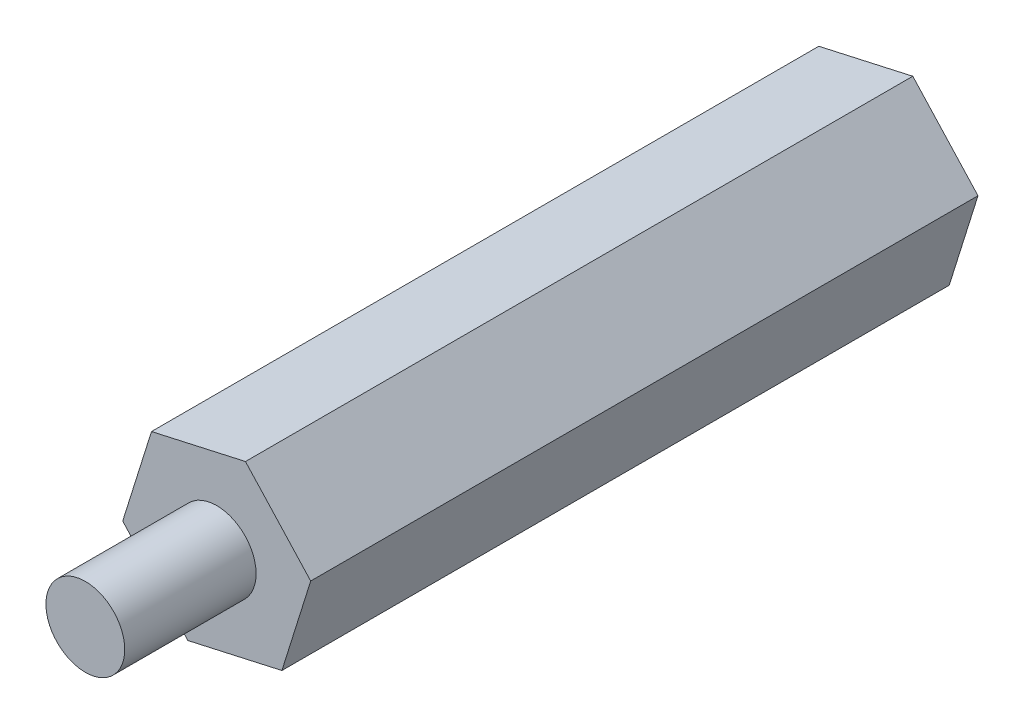
ISO-10303-21;
HEADER;
FILE_DESCRIPTION(('STEP AP214'),'2;1');
FILE_NAME('part.step','',(''),(''),'','','');
FILE_SCHEMA(('AUTOMOTIVE_DESIGN { 1 0 10303 214 1 1 1 1 }'));
ENDSEC;
DATA;
#1=APPLICATION_CONTEXT('core data for automotive mechanical design processes');
#2=APPLICATION_PROTOCOL_DEFINITION('international standard','automotive_design',2000,#1);
#3=PRODUCT_CONTEXT('',#1,'mechanical');
#4=PRODUCT('Part','Part','',(#3));
#5=PRODUCT_RELATED_PRODUCT_CATEGORY('part','',(#4));
#6=PRODUCT_DEFINITION_FORMATION('','',#4);
#7=PRODUCT_DEFINITION_CONTEXT('part definition',#1,'design');
#8=PRODUCT_DEFINITION('design','',#6,#7);
#9=PRODUCT_DEFINITION_SHAPE('','',#8);
#10=(LENGTH_UNIT() NAMED_UNIT(*) SI_UNIT(.MILLI.,.METRE.));
#11=(NAMED_UNIT(*) PLANE_ANGLE_UNIT() SI_UNIT($,.RADIAN.));
#12=(NAMED_UNIT(*) SI_UNIT($,.STERADIAN.) SOLID_ANGLE_UNIT());
#13=UNCERTAINTY_MEASURE_WITH_UNIT(LENGTH_MEASURE(1.E-05),#10,'distance_accuracy_value','');
#14=(GEOMETRIC_REPRESENTATION_CONTEXT(3) GLOBAL_UNCERTAINTY_ASSIGNED_CONTEXT((#13)) GLOBAL_UNIT_ASSIGNED_CONTEXT((#10,
#11,#12)) REPRESENTATION_CONTEXT('',''));
#15=CARTESIAN_POINT('',(0.,0.,0.));
#16=DIRECTION('',(0.,0.,1.));
#17=DIRECTION('',(1.,0.,0.));
#18=AXIS2_PLACEMENT_3D('',#15,#16,#17);
#19=CARTESIAN_POINT('',(0.,0.,30.4));
#20=DIRECTION('',(0.,0.,-1.));
#21=DIRECTION('',(-1.,0.,0.));
#22=AXIS2_PLACEMENT_3D('',#19,#20,#21);
#23=CYLINDRICAL_SURFACE('',#22,1.5);
#24=CARTESIAN_POINT('',(0.,0.,30.4));
#25=DIRECTION('',(0.,0.,1.));
#26=DIRECTION('',(1.,0.,0.));
#27=AXIS2_PLACEMENT_3D('',#24,#25,#26);
#28=CIRCLE('',#27,1.5);
#29=CARTESIAN_POINT('',(1.5,0.,30.4));
#30=VERTEX_POINT('',#29);
#31=EDGE_CURVE('E11',#30,#30,#28,.T.);
#32=ORIENTED_EDGE('',*,*,#31,.F.);
#33=EDGE_LOOP('',(#32));
#34=FACE_BOUND('',#33,.T.);
#35=CARTESIAN_POINT('',(0.,0.,25.4));
#36=DIRECTION('',(0.,0.,1.));
#37=DIRECTION('',(1.,0.,0.));
#38=AXIS2_PLACEMENT_3D('',#35,#36,#37);
#39=CIRCLE('',#38,1.5);
#40=CARTESIAN_POINT('',(1.5,0.,25.4));
#41=VERTEX_POINT('',#40);
#42=EDGE_CURVE('E44',#41,#41,#39,.T.);
#43=ORIENTED_EDGE('',*,*,#42,.T.);
#44=EDGE_LOOP('',(#43));
#45=FACE_BOUND('',#44,.T.);
#46=ADVANCED_FACE('F41',(#34,#45),#23,.T.);
#47=CARTESIAN_POINT('',(0.,0.,30.4));
#48=DIRECTION('',(0.,0.,1.));
#49=DIRECTION('',(1.,0.,0.));
#50=AXIS2_PLACEMENT_3D('',#47,#48,#49);
#51=PLANE('',#50);
#52=ORIENTED_EDGE('',*,*,#31,.T.);
#53=EDGE_LOOP('',(#52));
#54=FACE_BOUND('',#53,.T.);
#55=ADVANCED_FACE('F56',(#54),#51,.T.);
#56=CARTESIAN_POINT('',(0.,0.,25.4));
#57=DIRECTION('',(0.,0.,1.));
#58=DIRECTION('',(1.,0.,0.));
#59=AXIS2_PLACEMENT_3D('',#56,#57,#58);
#60=PLANE('',#59);
#61=ORIENTED_EDGE('',*,*,#42,.F.);
#62=EDGE_LOOP('',(#61));
#63=FACE_BOUND('',#62,.T.);
#64=ADVANCED_FACE('F54',(#63),#60,.F.);
#65=CLOSED_SHELL('',(#46,#55,#64));
#66=MANIFOLD_SOLID_BREP('B2',#65);
#67=CARTESIAN_POINT('',(0.,0.,25.4));
#68=DIRECTION('',(0.,0.,1.));
#69=DIRECTION('',(1.,0.,0.));
#70=AXIS2_PLACEMENT_3D('',#67,#68,#69);
#71=PLANE('',#70);
#72=DIRECTION('',(0.975877207402578,0.218320122920782,0.));
#73=VECTOR('',#72,1.);
#74=CARTESIAN_POINT('',(-1.09570153436444,-3.49860993552078,25.4));
#75=LINE('',#74,#73);
#76=CARTESIAN_POINT('',(-1.09570153436444,-3.49860993552078,25.4));
#77=VERTEX_POINT('',#76);
#78=CARTESIAN_POINT('',(2.48203431491141,-2.69821033148559,25.4));
#79=VERTEX_POINT('',#78);
#80=EDGE_CURVE('E178',#77,#79,#75,.T.);
#81=ORIENTED_EDGE('',*,*,#80,.T.);
#82=DIRECTION('',(0.298867831094551,0.954294514045239,0.));
#83=VECTOR('',#82,1.);
#84=CARTESIAN_POINT('',(2.48203431491141,-2.69821033148559,25.4));
#85=LINE('',#84,#83);
#86=CARTESIAN_POINT('',(3.57773584927586,0.800399604035192,25.4));
#87=VERTEX_POINT('',#86);
#88=EDGE_CURVE('E136',#79,#87,#85,.T.);
#89=ORIENTED_EDGE('',*,*,#88,.T.);
#90=DIRECTION('',(-0.677009376308027,0.735974391124457,0.));
#91=VECTOR('',#90,1.);
#92=CARTESIAN_POINT('',(3.57773584927586,0.800399604035192,25.4));
#93=LINE('',#92,#91);
#94=CARTESIAN_POINT('',(1.09570153436445,3.49860993552078,25.4));
#95=VERTEX_POINT('',#94);
#96=EDGE_CURVE('E149',#87,#95,#93,.T.);
#97=ORIENTED_EDGE('',*,*,#96,.T.);
#98=DIRECTION('',(-0.975877207402578,-0.218320122920782,0.));
#99=VECTOR('',#98,1.);
#100=CARTESIAN_POINT('',(1.09570153436445,3.49860993552078,25.4));
#101=LINE('',#100,#99);
#102=CARTESIAN_POINT('',(-2.48203431491141,2.69821033148559,25.4));
#103=VERTEX_POINT('',#102);
#104=EDGE_CURVE('E143',#95,#103,#101,.T.);
#105=ORIENTED_EDGE('',*,*,#104,.T.);
#106=DIRECTION('',(-0.298867831094551,-0.954294514045239,0.));
#107=VECTOR('',#106,1.);
#108=CARTESIAN_POINT('',(-2.48203431491141,2.69821033148559,25.4));
#109=LINE('',#108,#107);
#110=CARTESIAN_POINT('',(-3.57773584927586,-0.800399604035191,25.4));
#111=VERTEX_POINT('',#110);
#112=EDGE_CURVE('E147',#103,#111,#109,.T.);
#113=ORIENTED_EDGE('',*,*,#112,.T.);
#114=DIRECTION('',(0.677009376308027,-0.735974391124457,0.));
#115=VECTOR('',#114,1.);
#116=CARTESIAN_POINT('',(-3.57773584927586,-0.800399604035191,25.4));
#117=LINE('',#116,#115);
#118=EDGE_CURVE('E99',#111,#77,#117,.T.);
#119=ORIENTED_EDGE('',*,*,#118,.T.);
#120=EDGE_LOOP('',(#81,#89,#97,#105,#113,#119));
#121=FACE_BOUND('',#120,.T.);
#122=CARTESIAN_POINT('',(0.,0.,25.4));
#123=DIRECTION('',(0.,0.,1.));
#124=DIRECTION('',(1.,0.,0.));
#125=AXIS2_PLACEMENT_3D('',#122,#123,#124);
#126=CIRCLE('',#125,1.5);
#127=CARTESIAN_POINT('',(1.5,0.,25.4));
#128=VERTEX_POINT('',#127);
#129=EDGE_CURVE('E171',#128,#128,#126,.T.);
#130=ORIENTED_EDGE('',*,*,#129,.F.);
#131=EDGE_LOOP('',(#130));
#132=FACE_BOUND('',#131,.T.);
#133=ADVANCED_FACE('F82',(#121,#132),#71,.T.);
#134=CARTESIAN_POINT('',(0.,0.,0.));
#135=DIRECTION('',(0.,0.,1.));
#136=DIRECTION('',(1.,0.,0.));
#137=AXIS2_PLACEMENT_3D('',#134,#135,#136);
#138=PLANE('',#137);
#139=DIRECTION('',(0.975877207402578,0.218320122920782,0.));
#140=VECTOR('',#139,1.);
#141=CARTESIAN_POINT('',(-1.09570153436444,-3.49860993552078,0.));
#142=LINE('',#141,#140);
#143=CARTESIAN_POINT('',(-1.09570153436444,-3.49860993552078,0.));
#144=VERTEX_POINT('',#143);
#145=CARTESIAN_POINT('',(2.48203431491141,-2.69821033148559,0.));
#146=VERTEX_POINT('',#145);
#147=EDGE_CURVE('E167',#144,#146,#142,.T.);
#148=ORIENTED_EDGE('',*,*,#147,.F.);
#149=DIRECTION('',(0.677009376308027,-0.735974391124457,0.));
#150=VECTOR('',#149,1.);
#151=CARTESIAN_POINT('',(-3.57773584927586,-0.800399604035191,0.));
#152=LINE('',#151,#150);
#153=CARTESIAN_POINT('',(-3.57773584927586,-0.800399604035191,0.));
#154=VERTEX_POINT('',#153);
#155=EDGE_CURVE('E128',#154,#144,#152,.T.);
#156=ORIENTED_EDGE('',*,*,#155,.F.);
#157=DIRECTION('',(-0.298867831094551,-0.954294514045239,0.));
#158=VECTOR('',#157,1.);
#159=CARTESIAN_POINT('',(-2.48203431491141,2.69821033148559,0.));
#160=LINE('',#159,#158);
#161=CARTESIAN_POINT('',(-2.48203431491141,2.69821033148559,0.));
#162=VERTEX_POINT('',#161);
#163=EDGE_CURVE('E122',#162,#154,#160,.T.);
#164=ORIENTED_EDGE('',*,*,#163,.F.);
#165=DIRECTION('',(-0.975877207402578,-0.218320122920782,0.));
#166=VECTOR('',#165,1.);
#167=CARTESIAN_POINT('',(1.09570153436445,3.49860993552078,0.));
#168=LINE('',#167,#166);
#169=CARTESIAN_POINT('',(1.09570153436445,3.49860993552078,0.));
#170=VERTEX_POINT('',#169);
#171=EDGE_CURVE('E157',#170,#162,#168,.T.);
#172=ORIENTED_EDGE('',*,*,#171,.F.);
#173=DIRECTION('',(-0.677009376308027,0.735974391124457,0.));
#174=VECTOR('',#173,1.);
#175=CARTESIAN_POINT('',(3.57773584927586,0.800399604035192,0.));
#176=LINE('',#175,#174);
#177=CARTESIAN_POINT('',(3.57773584927586,0.800399604035192,0.));
#178=VERTEX_POINT('',#177);
#179=EDGE_CURVE('E173',#178,#170,#176,.T.);
#180=ORIENTED_EDGE('',*,*,#179,.F.);
#181=DIRECTION('',(0.298867831094551,0.954294514045239,0.));
#182=VECTOR('',#181,1.);
#183=CARTESIAN_POINT('',(2.48203431491141,-2.69821033148559,0.));
#184=LINE('',#183,#182);
#185=EDGE_CURVE('E170',#146,#178,#184,.T.);
#186=ORIENTED_EDGE('',*,*,#185,.F.);
#187=EDGE_LOOP('',(#148,#156,#164,#172,#180,#186));
#188=FACE_BOUND('',#187,.T.);
#189=CARTESIAN_POINT('',(0.,0.,0.));
#190=DIRECTION('',(0.,0.,1.));
#191=DIRECTION('',(1.,0.,0.));
#192=AXIS2_PLACEMENT_3D('',#189,#190,#191);
#193=CIRCLE('',#192,1.5);
#194=CARTESIAN_POINT('',(1.5,0.,0.));
#195=VERTEX_POINT('',#194);
#196=EDGE_CURVE('E271',#195,#195,#193,.T.);
#197=ORIENTED_EDGE('',*,*,#196,.T.);
#198=EDGE_LOOP('',(#197));
#199=FACE_BOUND('',#198,.T.);
#200=ADVANCED_FACE('F187',(#188,#199),#138,.F.);
#201=CARTESIAN_POINT('',(-1.09570153436444,-3.49860993552078,25.4));
#202=DIRECTION('',(-0.218320122920782,0.975877207402578,0.));
#203=DIRECTION('',(-0.975877207402578,-0.218320122920782,0.));
#204=AXIS2_PLACEMENT_3D('',#201,#202,#203);
#205=PLANE('',#204);
#206=ORIENTED_EDGE('',*,*,#147,.T.);
#207=DIRECTION('',(0.,0.,-1.));
#208=VECTOR('',#207,1.);
#209=CARTESIAN_POINT('',(2.48203431491141,-2.69821033148559,25.4));
#210=LINE('',#209,#208);
#211=EDGE_CURVE('E39',#79,#146,#210,.T.);
#212=ORIENTED_EDGE('',*,*,#211,.F.);
#213=ORIENTED_EDGE('',*,*,#80,.F.);
#214=DIRECTION('',(0.,0.,-1.));
#215=VECTOR('',#214,1.);
#216=CARTESIAN_POINT('',(-1.09570153436444,-3.49860993552078,25.4));
#217=LINE('',#216,#215);
#218=EDGE_CURVE('E163',#77,#144,#217,.T.);
#219=ORIENTED_EDGE('',*,*,#218,.T.);
#220=EDGE_LOOP('',(#206,#212,#213,#219));
#221=FACE_BOUND('',#220,.T.);
#222=ADVANCED_FACE('F84',(#221),#205,.F.);
#223=CARTESIAN_POINT('',(2.48203431491141,-2.69821033148559,25.4));
#224=DIRECTION('',(-0.954294514045239,0.298867831094551,0.));
#225=DIRECTION('',(-0.298867831094551,-0.954294514045239,0.));
#226=AXIS2_PLACEMENT_3D('',#223,#224,#225);
#227=PLANE('',#226);
#228=ORIENTED_EDGE('',*,*,#185,.T.);
#229=DIRECTION('',(0.,0.,-1.));
#230=VECTOR('',#229,1.);
#231=CARTESIAN_POINT('',(3.57773584927586,0.800399604035192,25.4));
#232=LINE('',#231,#230);
#233=EDGE_CURVE('E91',#87,#178,#232,.T.);
#234=ORIENTED_EDGE('',*,*,#233,.F.);
#235=ORIENTED_EDGE('',*,*,#88,.F.);
#236=ORIENTED_EDGE('',*,*,#211,.T.);
#237=EDGE_LOOP('',(#228,#234,#235,#236));
#238=FACE_BOUND('',#237,.T.);
#239=ADVANCED_FACE('F212',(#238),#227,.F.);
#240=CARTESIAN_POINT('',(3.57773584927586,0.800399604035192,25.4));
#241=DIRECTION('',(-0.735974391124457,-0.677009376308027,0.));
#242=DIRECTION('',(0.677009376308027,-0.735974391124457,0.));
#243=AXIS2_PLACEMENT_3D('',#240,#241,#242);
#244=PLANE('',#243);
#245=ORIENTED_EDGE('',*,*,#179,.T.);
#246=DIRECTION('',(0.,0.,-1.));
#247=VECTOR('',#246,1.);
#248=CARTESIAN_POINT('',(1.09570153436445,3.49860993552078,25.4));
#249=LINE('',#248,#247);
#250=EDGE_CURVE('E158',#95,#170,#249,.T.);
#251=ORIENTED_EDGE('',*,*,#250,.F.);
#252=ORIENTED_EDGE('',*,*,#96,.F.);
#253=ORIENTED_EDGE('',*,*,#233,.T.);
#254=EDGE_LOOP('',(#245,#251,#252,#253));
#255=FACE_BOUND('',#254,.T.);
#256=ADVANCED_FACE('F184',(#255),#244,.F.);
#257=CARTESIAN_POINT('',(1.09570153436445,3.49860993552078,25.4));
#258=DIRECTION('',(0.218320122920782,-0.975877207402578,0.));
#259=DIRECTION('',(0.975877207402578,0.218320122920782,0.));
#260=AXIS2_PLACEMENT_3D('',#257,#258,#259);
#261=PLANE('',#260);
#262=ORIENTED_EDGE('',*,*,#171,.T.);
#263=DIRECTION('',(0.,0.,-1.));
#264=VECTOR('',#263,1.);
#265=CARTESIAN_POINT('',(-2.48203431491141,2.69821033148559,25.4));
#266=LINE('',#265,#264);
#267=EDGE_CURVE('E154',#103,#162,#266,.T.);
#268=ORIENTED_EDGE('',*,*,#267,.F.);
#269=ORIENTED_EDGE('',*,*,#104,.F.);
#270=ORIENTED_EDGE('',*,*,#250,.T.);
#271=EDGE_LOOP('',(#262,#268,#269,#270));
#272=FACE_BOUND('',#271,.T.);
#273=ADVANCED_FACE('F155',(#272),#261,.F.);
#274=CARTESIAN_POINT('',(-2.48203431491141,2.69821033148559,25.4));
#275=DIRECTION('',(0.954294514045239,-0.298867831094551,0.));
#276=DIRECTION('',(0.298867831094551,0.954294514045239,0.));
#277=AXIS2_PLACEMENT_3D('',#274,#275,#276);
#278=PLANE('',#277);
#279=ORIENTED_EDGE('',*,*,#163,.T.);
#280=DIRECTION('',(0.,0.,-1.));
#281=VECTOR('',#280,1.);
#282=CARTESIAN_POINT('',(-3.57773584927586,-0.800399604035191,25.4));
#283=LINE('',#282,#281);
#284=EDGE_CURVE('E159',#111,#154,#283,.T.);
#285=ORIENTED_EDGE('',*,*,#284,.F.);
#286=ORIENTED_EDGE('',*,*,#112,.F.);
#287=ORIENTED_EDGE('',*,*,#267,.T.);
#288=EDGE_LOOP('',(#279,#285,#286,#287));
#289=FACE_BOUND('',#288,.T.);
#290=ADVANCED_FACE('F161',(#289),#278,.F.);
#291=CARTESIAN_POINT('',(-3.57773584927586,-0.800399604035191,25.4));
#292=DIRECTION('',(0.735974391124457,0.677009376308027,0.));
#293=DIRECTION('',(-0.677009376308027,0.735974391124457,0.));
#294=AXIS2_PLACEMENT_3D('',#291,#292,#293);
#295=PLANE('',#294);
#296=ORIENTED_EDGE('',*,*,#155,.T.);
#297=ORIENTED_EDGE('',*,*,#218,.F.);
#298=ORIENTED_EDGE('',*,*,#118,.F.);
#299=ORIENTED_EDGE('',*,*,#284,.T.);
#300=EDGE_LOOP('',(#296,#297,#298,#299));
#301=FACE_BOUND('',#300,.T.);
#302=ADVANCED_FACE('F192',(#301),#295,.F.);
#303=CARTESIAN_POINT('',(0.,0.,25.4));
#304=DIRECTION('',(0.,0.,-1.));
#305=DIRECTION('',(-1.,0.,0.));
#306=AXIS2_PLACEMENT_3D('',#303,#304,#305);
#307=CYLINDRICAL_SURFACE('',#306,1.5);
#308=ORIENTED_EDGE('',*,*,#129,.T.);
#309=EDGE_LOOP('',(#308));
#310=FACE_BOUND('',#309,.T.);
#311=ORIENTED_EDGE('',*,*,#196,.F.);
#312=EDGE_LOOP('',(#311));
#313=FACE_BOUND('',#312,.T.);
#314=ADVANCED_FACE('F194',(#310,#313),#307,.F.);
#315=CLOSED_SHELL('',(#133,#200,#222,#239,#256,#273,#290,#302,#314));
#316=MANIFOLD_SOLID_BREP('B6',#315);
#317=ADVANCED_BREP_SHAPE_REPRESENTATION('',(#18,#66,#316),#14);
#318=SHAPE_DEFINITION_REPRESENTATION(#9,#317);
ENDSEC;
END-ISO-10303-21;
